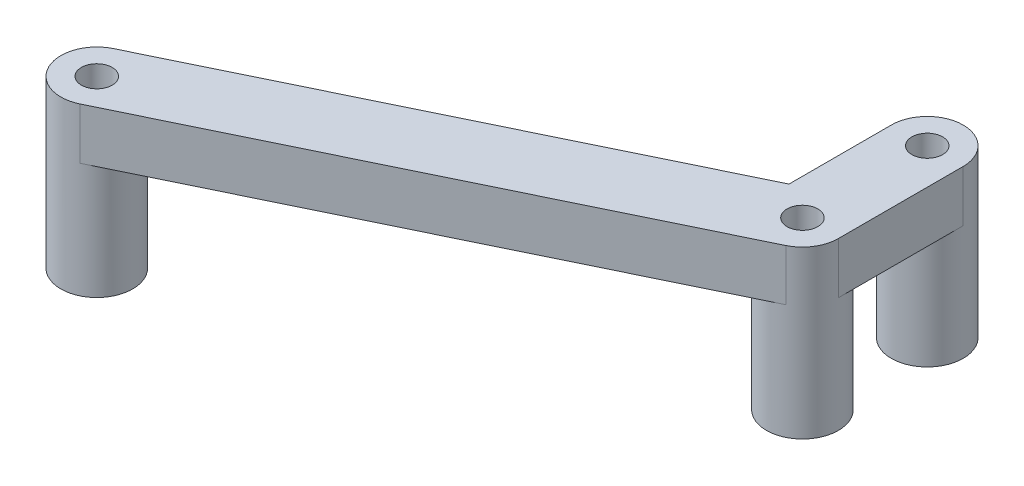
ISO-10303-21;
HEADER;
FILE_DESCRIPTION(('STEP AP214'),'2;1');
FILE_NAME('part.step','',(''),(''),'','','');
FILE_SCHEMA(('AUTOMOTIVE_DESIGN { 1 0 10303 214 1 1 1 1 }'));
ENDSEC;
DATA;
#1=APPLICATION_CONTEXT('core data for automotive mechanical design processes');
#2=APPLICATION_PROTOCOL_DEFINITION('international standard','automotive_design',2000,#1);
#3=PRODUCT_CONTEXT('',#1,'mechanical');
#4=PRODUCT('Part','Part','',(#3));
#5=PRODUCT_RELATED_PRODUCT_CATEGORY('part','',(#4));
#6=PRODUCT_DEFINITION_FORMATION('','',#4);
#7=PRODUCT_DEFINITION_CONTEXT('part definition',#1,'design');
#8=PRODUCT_DEFINITION('design','',#6,#7);
#9=PRODUCT_DEFINITION_SHAPE('','',#8);
#10=(LENGTH_UNIT() NAMED_UNIT(*) SI_UNIT(.MILLI.,.METRE.));
#11=(NAMED_UNIT(*) PLANE_ANGLE_UNIT() SI_UNIT($,.RADIAN.));
#12=(NAMED_UNIT(*) SI_UNIT($,.STERADIAN.) SOLID_ANGLE_UNIT());
#13=UNCERTAINTY_MEASURE_WITH_UNIT(LENGTH_MEASURE(1.E-05),#10,'distance_accuracy_value','');
#14=(GEOMETRIC_REPRESENTATION_CONTEXT(3) GLOBAL_UNCERTAINTY_ASSIGNED_CONTEXT((#13)) GLOBAL_UNIT_ASSIGNED_CONTEXT((#10,
#11,#12)) REPRESENTATION_CONTEXT('',''));
#15=CARTESIAN_POINT('',(0.,0.,0.));
#16=DIRECTION('',(0.,0.,1.));
#17=DIRECTION('',(1.,0.,0.));
#18=AXIS2_PLACEMENT_3D('',#15,#16,#17);
#19=CARTESIAN_POINT('',(-14.4526,3.175,10.5283));
#20=DIRECTION('',(0.,1.,0.));
#21=DIRECTION('',(0.,0.,1.));
#22=AXIS2_PLACEMENT_3D('',#19,#20,#21);
#23=PLANE('',#22);
#24=DIRECTION('',(-0.899952737353623,0.,0.435987466023646));
#25=VECTOR('',#24,1.);
#26=CARTESIAN_POINT('',(-15.4215821432376,3.175,8.52815504123157));
#27=LINE('',#26,#25);
#28=CARTESIAN_POINT('',(12.7381,3.175,-5.11397076391201));
#29=VERTEX_POINT('',#28);
#30=CARTESIAN_POINT('',(-15.4215821432376,3.175,8.52815504123157));
#31=VERTEX_POINT('',#30);
#32=EDGE_CURVE('E57',#29,#31,#27,.T.);
#33=ORIENTED_EDGE('',*,*,#32,.T.);
#34=CARTESIAN_POINT('',(-14.4526,3.175,10.5283));
#35=DIRECTION('',(0.,1.,0.));
#36=DIRECTION('',(0.,0.,1.));
#37=AXIS2_PLACEMENT_3D('',#34,#35,#36);
#38=CIRCLE('',#37,2.2225);
#39=CARTESIAN_POINT('',(-13.4836178567624,3.175,12.5284449587684));
#40=VERTEX_POINT('',#39);
#41=EDGE_CURVE('E143',#31,#40,#38,.T.);
#42=ORIENTED_EDGE('',*,*,#41,.T.);
#43=DIRECTION('',(0.899952737353623,0.,-0.435987466023647));
#44=VECTOR('',#43,1.);
#45=CARTESIAN_POINT('',(-13.4836178567624,3.175,12.5284449587684));
#46=LINE('',#45,#44);
#47=CARTESIAN_POINT('',(15.9295821432376,3.175,-1.72095504123157));
#48=VERTEX_POINT('',#47);
#49=EDGE_CURVE('E90',#40,#48,#46,.T.);
#50=ORIENTED_EDGE('',*,*,#49,.T.);
#51=CARTESIAN_POINT('',(14.9606,3.175,-3.7211));
#52=DIRECTION('',(0.,1.,0.));
#53=DIRECTION('',(0.,0.,1.));
#54=AXIS2_PLACEMENT_3D('',#51,#52,#53);
#55=CIRCLE('',#54,2.2225);
#56=CARTESIAN_POINT('',(17.1831,3.175,-3.7211));
#57=VERTEX_POINT('',#56);
#58=EDGE_CURVE('E164',#48,#57,#55,.T.);
#59=ORIENTED_EDGE('',*,*,#58,.T.);
#60=DIRECTION('',(0.,0.,-1.));
#61=VECTOR('',#60,1.);
#62=CARTESIAN_POINT('',(17.1831,3.175,-11.4427));
#63=LINE('',#62,#61);
#64=CARTESIAN_POINT('',(17.1831,3.175,-11.4427));
#65=VERTEX_POINT('',#64);
#66=EDGE_CURVE('E108',#57,#65,#63,.T.);
#67=ORIENTED_EDGE('',*,*,#66,.T.);
#68=CARTESIAN_POINT('',(14.9606,3.175,-11.4427));
#69=DIRECTION('',(0.,1.,0.));
#70=DIRECTION('',(0.,0.,1.));
#71=AXIS2_PLACEMENT_3D('',#68,#69,#70);
#72=CIRCLE('',#71,2.2225);
#73=CARTESIAN_POINT('',(12.7381,3.175,-11.4427));
#74=VERTEX_POINT('',#73);
#75=EDGE_CURVE('E102',#65,#74,#72,.T.);
#76=ORIENTED_EDGE('',*,*,#75,.T.);
#77=DIRECTION('',(0.,0.,1.));
#78=VECTOR('',#77,1.);
#79=CARTESIAN_POINT('',(12.7381,3.175,-11.4427));
#80=LINE('',#79,#78);
#81=EDGE_CURVE('E106',#74,#29,#80,.T.);
#82=ORIENTED_EDGE('',*,*,#81,.T.);
#83=EDGE_LOOP('',(#33,#42,#50,#59,#67,#76,#82));
#84=FACE_BOUND('',#83,.T.);
#85=CARTESIAN_POINT('',(14.9606,3.175,-11.4427));
#86=DIRECTION('',(0.,1.,0.));
#87=DIRECTION('',(0.,0.,1.));
#88=AXIS2_PLACEMENT_3D('',#85,#86,#87);
#89=CIRCLE('',#88,0.952500000000002);
#90=CARTESIAN_POINT('',(14.9606,3.175,-10.4902));
#91=VERTEX_POINT('',#90);
#92=EDGE_CURVE('E196',#91,#91,#89,.T.);
#93=ORIENTED_EDGE('',*,*,#92,.F.);
#94=EDGE_LOOP('',(#93));
#95=FACE_BOUND('',#94,.T.);
#96=CARTESIAN_POINT('',(14.9606,3.175,-3.7211));
#97=DIRECTION('',(0.,1.,0.));
#98=DIRECTION('',(0.,0.,1.));
#99=AXIS2_PLACEMENT_3D('',#96,#97,#98);
#100=CIRCLE('',#99,0.952500000000002);
#101=CARTESIAN_POINT('',(14.9606,3.175,-2.7686));
#102=VERTEX_POINT('',#101);
#103=EDGE_CURVE('E192',#102,#102,#100,.T.);
#104=ORIENTED_EDGE('',*,*,#103,.F.);
#105=EDGE_LOOP('',(#104));
#106=FACE_BOUND('',#105,.T.);
#107=CARTESIAN_POINT('',(-14.4526,3.175,10.5283));
#108=DIRECTION('',(0.,1.,0.));
#109=DIRECTION('',(0.,0.,1.));
#110=AXIS2_PLACEMENT_3D('',#107,#108,#109);
#111=CIRCLE('',#110,0.9525);
#112=CARTESIAN_POINT('',(-14.4526,3.175,11.4808));
#113=VERTEX_POINT('',#112);
#114=EDGE_CURVE('E134',#113,#113,#111,.T.);
#115=ORIENTED_EDGE('',*,*,#114,.F.);
#116=EDGE_LOOP('',(#115));
#117=FACE_BOUND('',#116,.T.);
#118=ADVANCED_FACE('F39',(#84,#95,#106,#117),#23,.T.);
#119=CARTESIAN_POINT('',(-14.4526,0.,10.5283));
#120=DIRECTION('',(0.,1.,0.));
#121=DIRECTION('',(0.,0.,1.));
#122=AXIS2_PLACEMENT_3D('',#119,#120,#121);
#123=PLANE('',#122);
#124=DIRECTION('',(0.899952737353623,0.,-0.435987466023647));
#125=VECTOR('',#124,1.);
#126=CARTESIAN_POINT('',(-13.4836178567624,0.,12.5284449587684));
#127=LINE('',#126,#125);
#128=CARTESIAN_POINT('',(-13.4836178567624,0.,12.5284449587684));
#129=VERTEX_POINT('',#128);
#130=CARTESIAN_POINT('',(15.9295821432376,0.,-1.72095504123157));
#131=VERTEX_POINT('',#130);
#132=EDGE_CURVE('E129',#129,#131,#127,.T.);
#133=ORIENTED_EDGE('',*,*,#132,.F.);
#134=CARTESIAN_POINT('',(-14.4526,0.,10.5283));
#135=DIRECTION('',(0.,1.,0.));
#136=DIRECTION('',(0.,0.,1.));
#137=AXIS2_PLACEMENT_3D('',#134,#135,#136);
#138=CIRCLE('',#137,2.2225);
#139=CARTESIAN_POINT('',(-15.4215821432376,0.,8.52815504123157));
#140=VERTEX_POINT('',#139);
#141=EDGE_CURVE('E172',#129,#140,#138,.T.);
#142=ORIENTED_EDGE('',*,*,#141,.T.);
#143=DIRECTION('',(-0.899952737353623,0.,0.435987466023646));
#144=VECTOR('',#143,1.);
#145=CARTESIAN_POINT('',(-15.4215821432376,0.,8.52815504123157));
#146=LINE('',#145,#144);
#147=CARTESIAN_POINT('',(12.7381,0.,-5.11397076391201));
#148=VERTEX_POINT('',#147);
#149=EDGE_CURVE('E139',#148,#140,#146,.T.);
#150=ORIENTED_EDGE('',*,*,#149,.F.);
#151=DIRECTION('',(0.,0.,1.));
#152=VECTOR('',#151,1.);
#153=CARTESIAN_POINT('',(12.7381,0.,-11.4427));
#154=LINE('',#153,#152);
#155=CARTESIAN_POINT('',(12.7381,0.,-11.4427));
#156=VERTEX_POINT('',#155);
#157=EDGE_CURVE('E82',#156,#148,#154,.T.);
#158=ORIENTED_EDGE('',*,*,#157,.F.);
#159=CARTESIAN_POINT('',(14.9606,0.,-11.4427));
#160=DIRECTION('',(0.,1.,0.));
#161=DIRECTION('',(0.,0.,1.));
#162=AXIS2_PLACEMENT_3D('',#159,#160,#161);
#163=CIRCLE('',#162,2.2225);
#164=CARTESIAN_POINT('',(17.1831,0.,-11.4427));
#165=VERTEX_POINT('',#164);
#166=EDGE_CURVE('E75',#156,#165,#163,.T.);
#167=ORIENTED_EDGE('',*,*,#166,.T.);
#168=DIRECTION('',(0.,0.,-1.));
#169=VECTOR('',#168,1.);
#170=CARTESIAN_POINT('',(17.1831,0.,-11.4427));
#171=LINE('',#170,#169);
#172=CARTESIAN_POINT('',(17.1831,0.,-3.7211));
#173=VERTEX_POINT('',#172);
#174=EDGE_CURVE('E133',#173,#165,#171,.T.);
#175=ORIENTED_EDGE('',*,*,#174,.F.);
#176=CARTESIAN_POINT('',(14.9606,0.,-3.7211));
#177=DIRECTION('',(0.,1.,0.));
#178=DIRECTION('',(0.,0.,1.));
#179=AXIS2_PLACEMENT_3D('',#176,#177,#178);
#180=CIRCLE('',#179,2.2225);
#181=EDGE_CURVE('E163',#173,#131,#180,.T.);
#182=ORIENTED_EDGE('',*,*,#181,.T.);
#183=EDGE_LOOP('',(#133,#142,#150,#158,#167,#175,#182));
#184=FACE_BOUND('',#183,.T.);
#185=ADVANCED_FACE('F169',(#184),#123,.F.);
#186=CARTESIAN_POINT('',(-14.4526,3.175,10.5283));
#187=DIRECTION('',(0.,-1.,0.));
#188=DIRECTION('',(0.,0.,-1.));
#189=AXIS2_PLACEMENT_3D('',#186,#187,#188);
#190=CYLINDRICAL_SURFACE('',#189,2.2225);
#191=DIRECTION('',(0.,-1.,0.));
#192=VECTOR('',#191,1.);
#193=CARTESIAN_POINT('',(-15.4215821432376,3.175,8.52815504123157));
#194=LINE('',#193,#192);
#195=EDGE_CURVE('E125',#31,#140,#194,.T.);
#196=ORIENTED_EDGE('',*,*,#195,.T.);
#197=ORIENTED_EDGE('',*,*,#141,.F.);
#198=DIRECTION('',(0.,-1.,0.));
#199=VECTOR('',#198,1.);
#200=CARTESIAN_POINT('',(-13.4836178567624,3.175,12.5284449587684));
#201=LINE('',#200,#199);
#202=EDGE_CURVE('E11',#40,#129,#201,.T.);
#203=ORIENTED_EDGE('',*,*,#202,.F.);
#204=ORIENTED_EDGE('',*,*,#41,.F.);
#205=EDGE_LOOP('',(#196,#197,#203,#204));
#206=FACE_BOUND('',#205,.T.);
#207=CARTESIAN_POINT('',(-14.4526,-7.112,10.5283));
#208=DIRECTION('',(0.,1.,0.));
#209=DIRECTION('',(0.,0.,1.));
#210=AXIS2_PLACEMENT_3D('',#207,#208,#209);
#211=CIRCLE('',#210,2.2225);
#212=CARTESIAN_POINT('',(-14.4526,-7.112,12.7508));
#213=VERTEX_POINT('',#212);
#214=EDGE_CURVE('E359',#213,#213,#211,.T.);
#215=ORIENTED_EDGE('',*,*,#214,.T.);
#216=EDGE_LOOP('',(#215));
#217=FACE_BOUND('',#216,.T.);
#218=ADVANCED_FACE('F41',(#206,#217),#190,.T.);
#219=CARTESIAN_POINT('',(-13.4836178567624,3.175,12.5284449587684));
#220=DIRECTION('',(-0.435987466023647,0.,-0.899952737353623));
#221=DIRECTION('',(-0.899952737353623,0.,0.435987466023647));
#222=AXIS2_PLACEMENT_3D('',#219,#220,#221);
#223=PLANE('',#222);
#224=ORIENTED_EDGE('',*,*,#132,.T.);
#225=DIRECTION('',(0.,-1.,0.));
#226=VECTOR('',#225,1.);
#227=CARTESIAN_POINT('',(15.9295821432376,3.175,-1.72095504123157));
#228=LINE('',#227,#226);
#229=EDGE_CURVE('E49',#48,#131,#228,.T.);
#230=ORIENTED_EDGE('',*,*,#229,.F.);
#231=ORIENTED_EDGE('',*,*,#49,.F.);
#232=ORIENTED_EDGE('',*,*,#202,.T.);
#233=EDGE_LOOP('',(#224,#230,#231,#232));
#234=FACE_BOUND('',#233,.T.);
#235=ADVANCED_FACE('F165',(#234),#223,.F.);
#236=CARTESIAN_POINT('',(14.9606,3.175,-3.7211));
#237=DIRECTION('',(0.,-1.,0.));
#238=DIRECTION('',(0.,0.,-1.));
#239=AXIS2_PLACEMENT_3D('',#236,#237,#238);
#240=CYLINDRICAL_SURFACE('',#239,2.2225);
#241=ORIENTED_EDGE('',*,*,#229,.T.);
#242=ORIENTED_EDGE('',*,*,#181,.F.);
#243=DIRECTION('',(0.,-1.,0.));
#244=VECTOR('',#243,1.);
#245=CARTESIAN_POINT('',(17.1831,3.175,-3.7211));
#246=LINE('',#245,#244);
#247=EDGE_CURVE('E151',#57,#173,#246,.T.);
#248=ORIENTED_EDGE('',*,*,#247,.F.);
#249=ORIENTED_EDGE('',*,*,#58,.F.);
#250=EDGE_LOOP('',(#241,#242,#248,#249));
#251=FACE_BOUND('',#250,.T.);
#252=CARTESIAN_POINT('',(14.9606,-7.112,-3.7211));
#253=DIRECTION('',(0.,1.,0.));
#254=DIRECTION('',(0.,0.,1.));
#255=AXIS2_PLACEMENT_3D('',#252,#253,#254);
#256=CIRCLE('',#255,2.2225);
#257=CARTESIAN_POINT('',(14.9606,-7.112,-1.4986));
#258=VERTEX_POINT('',#257);
#259=EDGE_CURVE('E175',#258,#258,#256,.T.);
#260=ORIENTED_EDGE('',*,*,#259,.T.);
#261=EDGE_LOOP('',(#260));
#262=FACE_BOUND('',#261,.T.);
#263=ADVANCED_FACE('F159',(#251,#262),#240,.T.);
#264=CARTESIAN_POINT('',(17.1831,3.175,-11.4427));
#265=DIRECTION('',(-1.,0.,0.));
#266=DIRECTION('',(0.,0.,1.));
#267=AXIS2_PLACEMENT_3D('',#264,#265,#266);
#268=PLANE('',#267);
#269=ORIENTED_EDGE('',*,*,#174,.T.);
#270=DIRECTION('',(0.,-1.,0.));
#271=VECTOR('',#270,1.);
#272=CARTESIAN_POINT('',(17.1831,3.175,-11.4427));
#273=LINE('',#272,#271);
#274=EDGE_CURVE('E118',#65,#165,#273,.T.);
#275=ORIENTED_EDGE('',*,*,#274,.F.);
#276=ORIENTED_EDGE('',*,*,#66,.F.);
#277=ORIENTED_EDGE('',*,*,#247,.T.);
#278=EDGE_LOOP('',(#269,#275,#276,#277));
#279=FACE_BOUND('',#278,.T.);
#280=ADVANCED_FACE('F210',(#279),#268,.F.);
#281=CARTESIAN_POINT('',(14.9606,3.175,-11.4427));
#282=DIRECTION('',(0.,-1.,0.));
#283=DIRECTION('',(0.,0.,-1.));
#284=AXIS2_PLACEMENT_3D('',#281,#282,#283);
#285=CYLINDRICAL_SURFACE('',#284,2.2225);
#286=ORIENTED_EDGE('',*,*,#274,.T.);
#287=ORIENTED_EDGE('',*,*,#166,.F.);
#288=DIRECTION('',(0.,-1.,0.));
#289=VECTOR('',#288,1.);
#290=CARTESIAN_POINT('',(12.7381,3.175,-11.4427));
#291=LINE('',#290,#289);
#292=EDGE_CURVE('E114',#74,#156,#291,.T.);
#293=ORIENTED_EDGE('',*,*,#292,.F.);
#294=ORIENTED_EDGE('',*,*,#75,.F.);
#295=EDGE_LOOP('',(#286,#287,#293,#294));
#296=FACE_BOUND('',#295,.T.);
#297=CARTESIAN_POINT('',(14.9606,-7.112,-11.4427));
#298=DIRECTION('',(0.,1.,0.));
#299=DIRECTION('',(0.,0.,1.));
#300=AXIS2_PLACEMENT_3D('',#297,#298,#299);
#301=CIRCLE('',#300,2.2225);
#302=CARTESIAN_POINT('',(14.9606,-7.112,-9.2202));
#303=VERTEX_POINT('',#302);
#304=EDGE_CURVE('E180',#303,#303,#301,.T.);
#305=ORIENTED_EDGE('',*,*,#304,.T.);
#306=EDGE_LOOP('',(#305));
#307=FACE_BOUND('',#306,.T.);
#308=ADVANCED_FACE('F115',(#296,#307),#285,.T.);
#309=CARTESIAN_POINT('',(12.7381,3.175,-11.4427));
#310=DIRECTION('',(1.,0.,0.));
#311=DIRECTION('',(0.,0.,-1.));
#312=AXIS2_PLACEMENT_3D('',#309,#310,#311);
#313=PLANE('',#312);
#314=ORIENTED_EDGE('',*,*,#157,.T.);
#315=DIRECTION('',(0.,-1.,0.));
#316=VECTOR('',#315,1.);
#317=CARTESIAN_POINT('',(12.7381,3.175,-5.11397076391201));
#318=LINE('',#317,#316);
#319=EDGE_CURVE('E119',#29,#148,#318,.T.);
#320=ORIENTED_EDGE('',*,*,#319,.F.);
#321=ORIENTED_EDGE('',*,*,#81,.F.);
#322=ORIENTED_EDGE('',*,*,#292,.T.);
#323=EDGE_LOOP('',(#314,#320,#321,#322));
#324=FACE_BOUND('',#323,.T.);
#325=ADVANCED_FACE('F121',(#324),#313,.F.);
#326=CARTESIAN_POINT('',(-15.4215821432376,3.175,8.52815504123157));
#327=DIRECTION('',(0.435987466023646,0.,0.899952737353623));
#328=DIRECTION('',(0.899952737353623,0.,-0.435987466023646));
#329=AXIS2_PLACEMENT_3D('',#326,#327,#328);
#330=PLANE('',#329);
#331=ORIENTED_EDGE('',*,*,#149,.T.);
#332=ORIENTED_EDGE('',*,*,#195,.F.);
#333=ORIENTED_EDGE('',*,*,#32,.F.);
#334=ORIENTED_EDGE('',*,*,#319,.T.);
#335=EDGE_LOOP('',(#331,#332,#333,#334));
#336=FACE_BOUND('',#335,.T.);
#337=ADVANCED_FACE('F229',(#336),#330,.F.);
#338=CARTESIAN_POINT('',(-14.4526,3.175,10.5283));
#339=DIRECTION('',(0.,-1.,0.));
#340=DIRECTION('',(0.,0.,-1.));
#341=AXIS2_PLACEMENT_3D('',#338,#339,#340);
#342=CYLINDRICAL_SURFACE('',#341,0.9525);
#343=ORIENTED_EDGE('',*,*,#114,.T.);
#344=EDGE_LOOP('',(#343));
#345=FACE_BOUND('',#344,.T.);
#346=CARTESIAN_POINT('',(-14.4526,-7.112,10.5283));
#347=DIRECTION('',(0.,1.,0.));
#348=DIRECTION('',(0.,0.,1.));
#349=AXIS2_PLACEMENT_3D('',#346,#347,#348);
#350=CIRCLE('',#349,0.9525);
#351=CARTESIAN_POINT('',(-14.4526,-7.112,11.4808));
#352=VERTEX_POINT('',#351);
#353=EDGE_CURVE('E362',#352,#352,#350,.T.);
#354=ORIENTED_EDGE('',*,*,#353,.F.);
#355=EDGE_LOOP('',(#354));
#356=FACE_BOUND('',#355,.T.);
#357=ADVANCED_FACE('F226',(#345,#356),#342,.F.);
#358=CARTESIAN_POINT('',(14.9606,3.175,-11.4427));
#359=DIRECTION('',(0.,-1.,0.));
#360=DIRECTION('',(0.,0.,-1.));
#361=AXIS2_PLACEMENT_3D('',#358,#359,#360);
#362=CYLINDRICAL_SURFACE('',#361,0.952500000000002);
#363=ORIENTED_EDGE('',*,*,#92,.T.);
#364=EDGE_LOOP('',(#363));
#365=FACE_BOUND('',#364,.T.);
#366=CARTESIAN_POINT('',(14.9606,-7.112,-11.4427));
#367=DIRECTION('',(0.,1.,0.));
#368=DIRECTION('',(0.,0.,1.));
#369=AXIS2_PLACEMENT_3D('',#366,#367,#368);
#370=CIRCLE('',#369,0.952500000000002);
#371=CARTESIAN_POINT('',(14.9606,-7.112,-10.4902));
#372=VERTEX_POINT('',#371);
#373=EDGE_CURVE('E174',#372,#372,#370,.T.);
#374=ORIENTED_EDGE('',*,*,#373,.F.);
#375=EDGE_LOOP('',(#374));
#376=FACE_BOUND('',#375,.T.);
#377=ADVANCED_FACE('F248',(#365,#376),#362,.F.);
#378=CARTESIAN_POINT('',(14.9606,3.175,-3.7211));
#379=DIRECTION('',(0.,-1.,0.));
#380=DIRECTION('',(0.,0.,-1.));
#381=AXIS2_PLACEMENT_3D('',#378,#379,#380);
#382=CYLINDRICAL_SURFACE('',#381,0.952500000000002);
#383=ORIENTED_EDGE('',*,*,#103,.T.);
#384=EDGE_LOOP('',(#383));
#385=FACE_BOUND('',#384,.T.);
#386=CARTESIAN_POINT('',(14.9606,-7.112,-3.7211));
#387=DIRECTION('',(0.,1.,0.));
#388=DIRECTION('',(0.,0.,1.));
#389=AXIS2_PLACEMENT_3D('',#386,#387,#388);
#390=CIRCLE('',#389,0.952500000000002);
#391=CARTESIAN_POINT('',(14.9606,-7.112,-2.7686));
#392=VERTEX_POINT('',#391);
#393=EDGE_CURVE('E183',#392,#392,#390,.T.);
#394=ORIENTED_EDGE('',*,*,#393,.F.);
#395=EDGE_LOOP('',(#394));
#396=FACE_BOUND('',#395,.T.);
#397=ADVANCED_FACE('F255',(#385,#396),#382,.F.);
#398=CARTESIAN_POINT('',(14.9606,-7.112,-11.4427));
#399=DIRECTION('',(0.,1.,0.));
#400=DIRECTION('',(0.,0.,1.));
#401=AXIS2_PLACEMENT_3D('',#398,#399,#400);
#402=PLANE('',#401);
#403=ORIENTED_EDGE('',*,*,#373,.T.);
#404=EDGE_LOOP('',(#403));
#405=FACE_BOUND('',#404,.T.);
#406=ORIENTED_EDGE('',*,*,#304,.F.);
#407=EDGE_LOOP('',(#406));
#408=FACE_BOUND('',#407,.T.);
#409=ADVANCED_FACE('F262',(#405,#408),#402,.F.);
#410=CARTESIAN_POINT('',(14.9606,-7.112,-3.7211));
#411=DIRECTION('',(0.,1.,0.));
#412=DIRECTION('',(0.,0.,1.));
#413=AXIS2_PLACEMENT_3D('',#410,#411,#412);
#414=PLANE('',#413);
#415=ORIENTED_EDGE('',*,*,#393,.T.);
#416=EDGE_LOOP('',(#415));
#417=FACE_BOUND('',#416,.T.);
#418=ORIENTED_EDGE('',*,*,#259,.F.);
#419=EDGE_LOOP('',(#418));
#420=FACE_BOUND('',#419,.T.);
#421=ADVANCED_FACE('F270',(#417,#420),#414,.F.);
#422=CARTESIAN_POINT('',(-14.4526,-7.112,10.5283));
#423=DIRECTION('',(0.,1.,0.));
#424=DIRECTION('',(0.,0.,1.));
#425=AXIS2_PLACEMENT_3D('',#422,#423,#424);
#426=PLANE('',#425);
#427=ORIENTED_EDGE('',*,*,#353,.T.);
#428=EDGE_LOOP('',(#427));
#429=FACE_BOUND('',#428,.T.);
#430=ORIENTED_EDGE('',*,*,#214,.F.);
#431=EDGE_LOOP('',(#430));
#432=FACE_BOUND('',#431,.T.);
#433=ADVANCED_FACE('F278',(#429,#432),#426,.F.);
#434=CLOSED_SHELL('',(#118,#185,#218,#235,#263,#280,#308,#325,#337,#357,#377,#397,#409,#421,#433));
#435=MANIFOLD_SOLID_BREP('B2',#434);
#436=ADVANCED_BREP_SHAPE_REPRESENTATION('',(#18,#435),#14);
#437=SHAPE_DEFINITION_REPRESENTATION(#9,#436);
ENDSEC;
END-ISO-10303-21;
